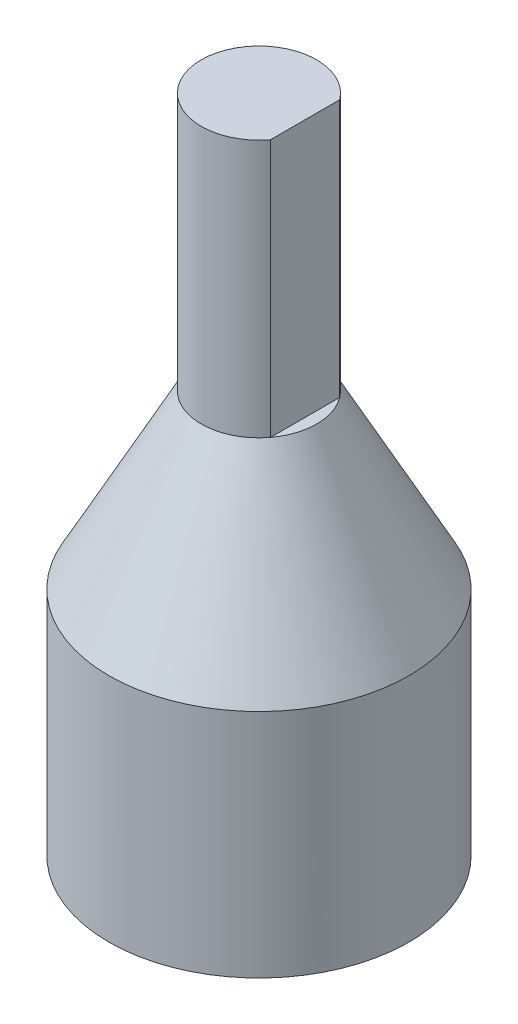
ISO-10303-21;
HEADER;
FILE_DESCRIPTION(('STEP AP214'),'2;1');
FILE_NAME('part.step','',(''),(''),'','','');
FILE_SCHEMA(('AUTOMOTIVE_DESIGN { 1 0 10303 214 1 1 1 1 }'));
ENDSEC;
DATA;
#1=APPLICATION_CONTEXT('core data for automotive mechanical design processes');
#2=APPLICATION_PROTOCOL_DEFINITION('international standard','automotive_design',2000,#1);
#3=PRODUCT_CONTEXT('',#1,'mechanical');
#4=PRODUCT('Part','Part','',(#3));
#5=PRODUCT_RELATED_PRODUCT_CATEGORY('part','',(#4));
#6=PRODUCT_DEFINITION_FORMATION('','',#4);
#7=PRODUCT_DEFINITION_CONTEXT('part definition',#1,'design');
#8=PRODUCT_DEFINITION('design','',#6,#7);
#9=PRODUCT_DEFINITION_SHAPE('','',#8);
#10=(LENGTH_UNIT() NAMED_UNIT(*) SI_UNIT(.MILLI.,.METRE.));
#11=(NAMED_UNIT(*) PLANE_ANGLE_UNIT() SI_UNIT($,.RADIAN.));
#12=(NAMED_UNIT(*) SI_UNIT($,.STERADIAN.) SOLID_ANGLE_UNIT());
#13=UNCERTAINTY_MEASURE_WITH_UNIT(LENGTH_MEASURE(1.E-05),#10,'distance_accuracy_value','');
#14=(GEOMETRIC_REPRESENTATION_CONTEXT(3) GLOBAL_UNCERTAINTY_ASSIGNED_CONTEXT((#13)) GLOBAL_UNIT_ASSIGNED_CONTEXT((#10,
#11,#12)) REPRESENTATION_CONTEXT('',''));
#15=CARTESIAN_POINT('',(0.,0.,0.));
#16=DIRECTION('',(0.,0.,1.));
#17=DIRECTION('',(1.,0.,0.));
#18=AXIS2_PLACEMENT_3D('',#15,#16,#17);
#19=CARTESIAN_POINT('',(4.445,0.,-5.08));
#20=DIRECTION('',(0.,1.,0.));
#21=DIRECTION('',(0.,0.,1.));
#22=AXIS2_PLACEMENT_3D('',#19,#20,#21);
#23=PLANE('',#22);
#24=CARTESIAN_POINT('',(4.445,0.,-5.08));
#25=DIRECTION('',(0.,1.,0.));
#26=DIRECTION('',(0.,0.,1.));
#27=AXIS2_PLACEMENT_3D('',#24,#25,#26);
#28=CIRCLE('',#27,8.255);
#29=CARTESIAN_POINT('',(4.445,0.,3.175));
#30=VERTEX_POINT('',#29);
#31=EDGE_CURVE('E151',#30,#30,#28,.T.);
#32=ORIENTED_EDGE('',*,*,#31,.F.);
#33=EDGE_LOOP('',(#32));
#34=FACE_BOUND('',#33,.T.);
#35=DIRECTION('',(1.,0.,0.));
#36=VECTOR('',#35,1.);
#37=CARTESIAN_POINT('',(4.445,0.,0.));
#38=LINE('',#37,#36);
#39=CARTESIAN_POINT('',(-0.634999999999998,0.,0.));
#40=VERTEX_POINT('',#39);
#41=CARTESIAN_POINT('',(9.525,0.,0.));
#42=VERTEX_POINT('',#41);
#43=EDGE_CURVE('E116',#40,#42,#38,.T.);
#44=ORIENTED_EDGE('',*,*,#43,.T.);
#45=DIRECTION('',(0.,0.,-1.));
#46=VECTOR('',#45,1.);
#47=CARTESIAN_POINT('',(9.525,0.,0.));
#48=LINE('',#47,#46);
#49=CARTESIAN_POINT('',(9.525,0.,-10.16));
#50=VERTEX_POINT('',#49);
#51=EDGE_CURVE('E120',#42,#50,#48,.T.);
#52=ORIENTED_EDGE('',*,*,#51,.T.);
#53=DIRECTION('',(-1.,0.,0.));
#54=VECTOR('',#53,1.);
#55=CARTESIAN_POINT('',(9.525,0.,-10.16));
#56=LINE('',#55,#54);
#57=CARTESIAN_POINT('',(-0.634999999999998,0.,-10.16));
#58=VERTEX_POINT('',#57);
#59=EDGE_CURVE('E139',#50,#58,#56,.T.);
#60=ORIENTED_EDGE('',*,*,#59,.T.);
#61=DIRECTION('',(0.,0.,1.));
#62=VECTOR('',#61,1.);
#63=CARTESIAN_POINT('',(-0.634999999999998,0.,-10.16));
#64=LINE('',#63,#62);
#65=EDGE_CURVE('E129',#58,#40,#64,.T.);
#66=ORIENTED_EDGE('',*,*,#65,.T.);
#67=EDGE_LOOP('',(#44,#52,#60,#66));
#68=FACE_BOUND('',#67,.T.);
#69=ADVANCED_FACE('F51',(#34,#68),#23,.F.);
#70=CARTESIAN_POINT('',(4.445,12.7,-5.08));
#71=DIRECTION('',(0.,-1.,0.));
#72=DIRECTION('',(0.,0.,-1.));
#73=AXIS2_PLACEMENT_3D('',#70,#71,#72);
#74=CYLINDRICAL_SURFACE('',#73,8.255);
#75=CARTESIAN_POINT('',(4.445,12.7,-5.08));
#76=DIRECTION('',(0.,1.,0.));
#77=DIRECTION('',(0.,0.,1.));
#78=AXIS2_PLACEMENT_3D('',#75,#76,#77);
#79=CIRCLE('',#78,8.255);
#80=CARTESIAN_POINT('',(4.445,12.7,3.175));
#81=VERTEX_POINT('',#80);
#82=EDGE_CURVE('E152',#81,#81,#79,.T.);
#83=ORIENTED_EDGE('',*,*,#82,.F.);
#84=EDGE_LOOP('',(#83));
#85=FACE_BOUND('',#84,.T.);
#86=ORIENTED_EDGE('',*,*,#31,.T.);
#87=EDGE_LOOP('',(#86));
#88=FACE_BOUND('',#87,.T.);
#89=ADVANCED_FACE('F53',(#85,#88),#74,.T.);
#90=CARTESIAN_POINT('',(4.445,12.7,0.));
#91=DIRECTION('',(0.,0.,-1.));
#92=DIRECTION('',(-1.,0.,0.));
#93=AXIS2_PLACEMENT_3D('',#90,#91,#92);
#94=PLANE('',#93);
#95=ORIENTED_EDGE('',*,*,#43,.F.);
#96=DIRECTION('',(0.,-1.,0.));
#97=VECTOR('',#96,1.);
#98=CARTESIAN_POINT('',(-0.634999999999998,12.7,0.));
#99=LINE('',#98,#97);
#100=CARTESIAN_POINT('',(-0.634999999999998,12.7,0.));
#101=VERTEX_POINT('',#100);
#102=EDGE_CURVE('E135',#101,#40,#99,.T.);
#103=ORIENTED_EDGE('',*,*,#102,.F.);
#104=DIRECTION('',(1.,0.,0.));
#105=VECTOR('',#104,1.);
#106=CARTESIAN_POINT('',(-0.634999999999998,12.7,0.));
#107=LINE('',#106,#105);
#108=CARTESIAN_POINT('',(9.525,12.7,0.));
#109=VERTEX_POINT('',#108);
#110=EDGE_CURVE('E125',#101,#109,#107,.T.);
#111=ORIENTED_EDGE('',*,*,#110,.T.);
#112=DIRECTION('',(0.,-1.,0.));
#113=VECTOR('',#112,1.);
#114=CARTESIAN_POINT('',(9.525,12.7,0.));
#115=LINE('',#114,#113);
#116=EDGE_CURVE('E149',#109,#42,#115,.T.);
#117=ORIENTED_EDGE('',*,*,#116,.T.);
#118=EDGE_LOOP('',(#95,#103,#111,#117));
#119=FACE_BOUND('',#118,.T.);
#120=ADVANCED_FACE('F169',(#119),#94,.T.);
#121=CARTESIAN_POINT('',(9.525,12.7,0.));
#122=DIRECTION('',(-1.,0.,0.));
#123=DIRECTION('',(0.,0.,1.));
#124=AXIS2_PLACEMENT_3D('',#121,#122,#123);
#125=PLANE('',#124);
#126=ORIENTED_EDGE('',*,*,#51,.F.);
#127=ORIENTED_EDGE('',*,*,#116,.F.);
#128=DIRECTION('',(0.,0.,-1.));
#129=VECTOR('',#128,1.);
#130=CARTESIAN_POINT('',(9.525,12.7,0.));
#131=LINE('',#130,#129);
#132=CARTESIAN_POINT('',(9.525,12.7,-10.16));
#133=VERTEX_POINT('',#132);
#134=EDGE_CURVE('E128',#109,#133,#131,.T.);
#135=ORIENTED_EDGE('',*,*,#134,.T.);
#136=DIRECTION('',(0.,-1.,0.));
#137=VECTOR('',#136,1.);
#138=CARTESIAN_POINT('',(9.525,12.7,-10.16));
#139=LINE('',#138,#137);
#140=EDGE_CURVE('E147',#133,#50,#139,.T.);
#141=ORIENTED_EDGE('',*,*,#140,.T.);
#142=EDGE_LOOP('',(#126,#127,#135,#141));
#143=FACE_BOUND('',#142,.T.);
#144=ADVANCED_FACE('F181',(#143),#125,.T.);
#145=CARTESIAN_POINT('',(9.525,12.7,-10.16));
#146=DIRECTION('',(0.,0.,1.));
#147=DIRECTION('',(1.,0.,0.));
#148=AXIS2_PLACEMENT_3D('',#145,#146,#147);
#149=PLANE('',#148);
#150=ORIENTED_EDGE('',*,*,#59,.F.);
#151=ORIENTED_EDGE('',*,*,#140,.F.);
#152=DIRECTION('',(-1.,0.,0.));
#153=VECTOR('',#152,1.);
#154=CARTESIAN_POINT('',(9.525,12.7,-10.16));
#155=LINE('',#154,#153);
#156=CARTESIAN_POINT('',(-0.634999999999998,12.7,-10.16));
#157=VERTEX_POINT('',#156);
#158=EDGE_CURVE('E132',#133,#157,#155,.T.);
#159=ORIENTED_EDGE('',*,*,#158,.T.);
#160=DIRECTION('',(0.,-1.,0.));
#161=VECTOR('',#160,1.);
#162=CARTESIAN_POINT('',(-0.634999999999998,12.7,-10.16));
#163=LINE('',#162,#161);
#164=EDGE_CURVE('E145',#157,#58,#163,.T.);
#165=ORIENTED_EDGE('',*,*,#164,.T.);
#166=EDGE_LOOP('',(#150,#151,#159,#165));
#167=FACE_BOUND('',#166,.T.);
#168=ADVANCED_FACE('F185',(#167),#149,.T.);
#169=CARTESIAN_POINT('',(-0.634999999999998,12.7,-10.16));
#170=DIRECTION('',(1.,0.,0.));
#171=DIRECTION('',(0.,0.,-1.));
#172=AXIS2_PLACEMENT_3D('',#169,#170,#171);
#173=PLANE('',#172);
#174=ORIENTED_EDGE('',*,*,#65,.F.);
#175=ORIENTED_EDGE('',*,*,#164,.F.);
#176=DIRECTION('',(0.,0.,1.));
#177=VECTOR('',#176,1.);
#178=CARTESIAN_POINT('',(-0.634999999999998,12.7,-10.16));
#179=LINE('',#178,#177);
#180=EDGE_CURVE('E73',#157,#101,#179,.T.);
#181=ORIENTED_EDGE('',*,*,#180,.T.);
#182=ORIENTED_EDGE('',*,*,#102,.T.);
#183=EDGE_LOOP('',(#174,#175,#181,#182));
#184=FACE_BOUND('',#183,.T.);
#185=ADVANCED_FACE('F187',(#184),#173,.T.);
#186=CARTESIAN_POINT('',(0.,12.7,-5.08));
#187=DIRECTION('',(0.,1.,0.));
#188=DIRECTION('',(0.,0.,1.));
#189=AXIS2_PLACEMENT_3D('',#186,#187,#188);
#190=PLANE('',#189);
#191=ORIENTED_EDGE('',*,*,#134,.F.);
#192=ORIENTED_EDGE('',*,*,#110,.F.);
#193=ORIENTED_EDGE('',*,*,#180,.F.);
#194=ORIENTED_EDGE('',*,*,#158,.F.);
#195=EDGE_LOOP('',(#191,#192,#193,#194));
#196=FACE_BOUND('',#195,.T.);
#197=ADVANCED_FACE('F163',(#196),#190,.F.);
#198=CARTESIAN_POINT('',(4.445,12.7,-5.08));
#199=DIRECTION('',(0.,-1.,0.));
#200=DIRECTION('',(0.,0.,-1.));
#201=AXIS2_PLACEMENT_3D('',#198,#199,#200);
#202=CONICAL_SURFACE('',#201,8.255,0.493215235911487);
#203=CARTESIAN_POINT('',(4.445,22.1507190768458,-5.08));
#204=DIRECTION('',(0.,-1.,0.));
#205=DIRECTION('',(0.,0.,-1.));
#206=AXIS2_PLACEMENT_3D('',#203,#204,#205);
#207=CIRCLE('',#206,3.17499999999999);
#208=CARTESIAN_POINT('',(6.985,22.1507190768458,-6.985));
#209=VERTEX_POINT('',#208);
#210=CARTESIAN_POINT('',(6.985,22.1507190768458,-3.175));
#211=VERTEX_POINT('',#210);
#212=EDGE_CURVE('E117',#209,#211,#207,.T.);
#213=ORIENTED_EDGE('',*,*,#212,.T.);
#214=EDGE_CURVE('E122',#211,#209,#207,.T.);
#215=ORIENTED_EDGE('',*,*,#214,.T.);
#216=EDGE_LOOP('',(#213,#215));
#217=FACE_BOUND('',#216,.T.);
#218=ORIENTED_EDGE('',*,*,#82,.T.);
#219=EDGE_LOOP('',(#218));
#220=FACE_BOUND('',#219,.T.);
#221=ADVANCED_FACE('F160',(#217,#220),#202,.T.);
#222=CARTESIAN_POINT('',(0.,36.3360094768458,-5.08));
#223=DIRECTION('',(0.,1.,0.));
#224=DIRECTION('',(0.,0.,1.));
#225=AXIS2_PLACEMENT_3D('',#222,#223,#224);
#226=PLANE('',#225);
#227=DIRECTION('',(0.,0.,1.));
#228=VECTOR('',#227,1.);
#229=CARTESIAN_POINT('',(6.985,36.3360094768458,-17.78));
#230=LINE('',#229,#228);
#231=CARTESIAN_POINT('',(6.985,36.3360094768458,-6.985));
#232=VERTEX_POINT('',#231);
#233=CARTESIAN_POINT('',(6.985,36.3360094768458,-3.175));
#234=VERTEX_POINT('',#233);
#235=EDGE_CURVE('E65',#232,#234,#230,.T.);
#236=ORIENTED_EDGE('',*,*,#235,.F.);
#237=CARTESIAN_POINT('',(4.445,36.3360094768458,-5.08));
#238=DIRECTION('',(0.,-1.,0.));
#239=DIRECTION('',(0.,0.,-1.));
#240=AXIS2_PLACEMENT_3D('',#237,#238,#239);
#241=CIRCLE('',#240,3.175);
#242=EDGE_CURVE('E113',#234,#232,#241,.T.);
#243=ORIENTED_EDGE('',*,*,#242,.F.);
#244=EDGE_LOOP('',(#236,#243));
#245=FACE_BOUND('',#244,.T.);
#246=ADVANCED_FACE('F112',(#245),#226,.T.);
#247=CARTESIAN_POINT('',(4.445,36.3360094768458,-5.08));
#248=DIRECTION('',(0.,-1.,0.));
#249=DIRECTION('',(0.,0.,-1.));
#250=AXIS2_PLACEMENT_3D('',#247,#248,#249);
#251=CYLINDRICAL_SURFACE('',#250,3.175);
#252=DIRECTION('',(0.,-1.,0.));
#253=VECTOR('',#252,1.);
#254=CARTESIAN_POINT('',(6.985,36.3360094768458,-6.985));
#255=LINE('',#254,#253);
#256=EDGE_CURVE('E13',#209,#232,#255,.F.);
#257=ORIENTED_EDGE('',*,*,#256,.F.);
#258=ORIENTED_EDGE('',*,*,#214,.F.);
#259=DIRECTION('',(0.,-1.,0.));
#260=VECTOR('',#259,1.);
#261=CARTESIAN_POINT('',(6.985,36.3360094768458,-3.175));
#262=LINE('',#261,#260);
#263=EDGE_CURVE('E59',#234,#211,#262,.T.);
#264=ORIENTED_EDGE('',*,*,#263,.F.);
#265=ORIENTED_EDGE('',*,*,#242,.T.);
#266=EDGE_LOOP('',(#257,#258,#264,#265));
#267=FACE_BOUND('',#266,.T.);
#268=ADVANCED_FACE('F115',(#267),#251,.T.);
#269=CARTESIAN_POINT('',(6.985,22.1507190768458,-17.78));
#270=DIRECTION('',(0.,-1.,0.));
#271=DIRECTION('',(0.,0.,-1.));
#272=AXIS2_PLACEMENT_3D('',#269,#270,#271);
#273=PLANE('',#272);
#274=DIRECTION('',(0.,0.,1.));
#275=VECTOR('',#274,1.);
#276=CARTESIAN_POINT('',(6.985,22.1507190768458,-17.78));
#277=LINE('',#276,#275);
#278=EDGE_CURVE('E105',#209,#211,#277,.T.);
#279=ORIENTED_EDGE('',*,*,#278,.T.);
#280=ORIENTED_EDGE('',*,*,#212,.F.);
#281=EDGE_LOOP('',(#279,#280));
#282=FACE_BOUND('',#281,.T.);
#283=ADVANCED_FACE('F157',(#282),#273,.F.);
#284=CARTESIAN_POINT('',(6.985,36.3360094768458,-17.78));
#285=DIRECTION('',(-1.,0.,0.));
#286=DIRECTION('',(0.,0.,1.));
#287=AXIS2_PLACEMENT_3D('',#284,#285,#286);
#288=PLANE('',#287);
#289=ORIENTED_EDGE('',*,*,#256,.T.);
#290=ORIENTED_EDGE('',*,*,#235,.T.);
#291=ORIENTED_EDGE('',*,*,#263,.T.);
#292=ORIENTED_EDGE('',*,*,#278,.F.);
#293=EDGE_LOOP('',(#289,#290,#291,#292));
#294=FACE_BOUND('',#293,.T.);
#295=ADVANCED_FACE('F103',(#294),#288,.F.);
#296=CLOSED_SHELL('',(#69,#89,#120,#144,#168,#185,#197,#221,#246,#268,#283,#295));
#297=MANIFOLD_SOLID_BREP('B2',#296);
#298=ADVANCED_BREP_SHAPE_REPRESENTATION('',(#18,#297),#14);
#299=SHAPE_DEFINITION_REPRESENTATION(#9,#298);
ENDSEC;
END-ISO-10303-21;
